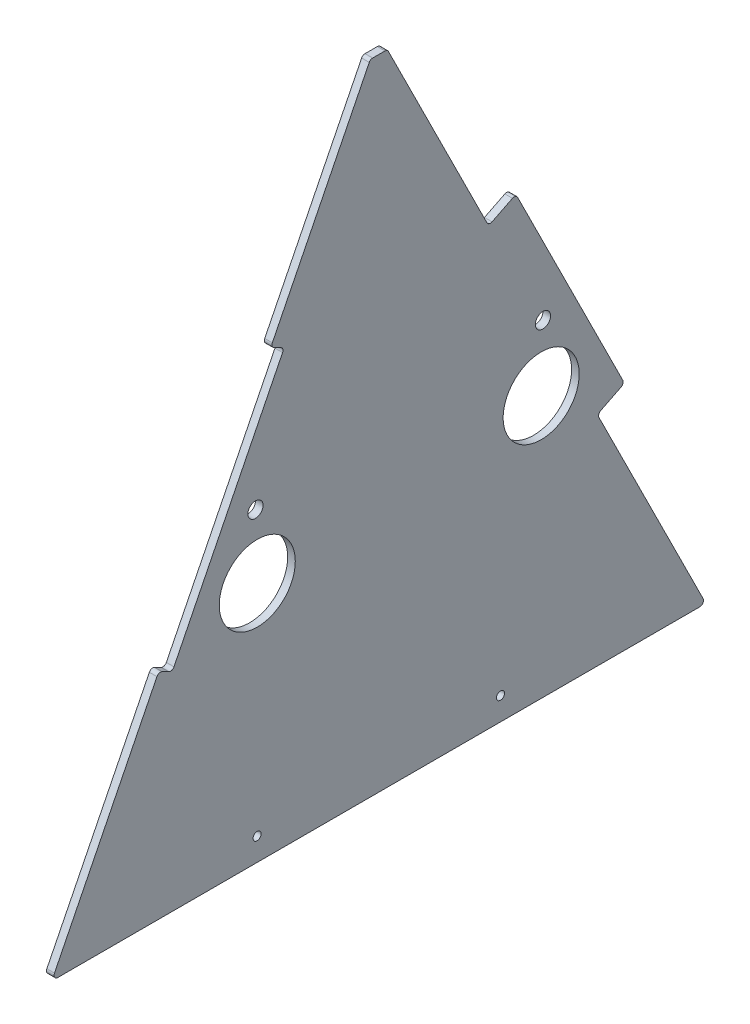
ISO-10303-21;
HEADER;
FILE_DESCRIPTION(('STEP AP214'),'2;1');
FILE_NAME('part.step','',(''),(''),'','','');
FILE_SCHEMA(('AUTOMOTIVE_DESIGN { 1 0 10303 214 1 1 1 1 }'));
ENDSEC;
DATA;
#1=APPLICATION_CONTEXT('core data for automotive mechanical design processes');
#2=APPLICATION_PROTOCOL_DEFINITION('international standard','automotive_design',2000,#1);
#3=PRODUCT_CONTEXT('',#1,'mechanical');
#4=PRODUCT('Part','Part','',(#3));
#5=PRODUCT_RELATED_PRODUCT_CATEGORY('part','',(#4));
#6=PRODUCT_DEFINITION_FORMATION('','',#4);
#7=PRODUCT_DEFINITION_CONTEXT('part definition',#1,'design');
#8=PRODUCT_DEFINITION('design','',#6,#7);
#9=PRODUCT_DEFINITION_SHAPE('','',#8);
#10=(LENGTH_UNIT() NAMED_UNIT(*) SI_UNIT(.MILLI.,.METRE.));
#11=(NAMED_UNIT(*) PLANE_ANGLE_UNIT() SI_UNIT($,.RADIAN.));
#12=(NAMED_UNIT(*) SI_UNIT($,.STERADIAN.) SOLID_ANGLE_UNIT());
#13=UNCERTAINTY_MEASURE_WITH_UNIT(LENGTH_MEASURE(1.E-05),#10,'distance_accuracy_value','');
#14=(GEOMETRIC_REPRESENTATION_CONTEXT(3) GLOBAL_UNCERTAINTY_ASSIGNED_CONTEXT((#13)) GLOBAL_UNIT_ASSIGNED_CONTEXT((#10,
#11,#12)) REPRESENTATION_CONTEXT('',''));
#15=CARTESIAN_POINT('',(0.,0.,0.));
#16=DIRECTION('',(0.,0.,1.));
#17=DIRECTION('',(1.,0.,0.));
#18=AXIS2_PLACEMENT_3D('',#15,#16,#17);
#19=CARTESIAN_POINT('',(6.35,0.,0.));
#20=DIRECTION('',(1.,0.,0.));
#21=DIRECTION('',(0.,0.,-1.));
#22=AXIS2_PLACEMENT_3D('',#19,#20,#21);
#23=PLANE('',#22);
#24=CARTESIAN_POINT('',(6.35,201.821183312528,-171.579254548243));
#25=DIRECTION('',(1.,0.,0.));
#26=DIRECTION('',(0.,0.,-1.));
#27=AXIS2_PLACEMENT_3D('',#24,#25,#26);
#28=CIRCLE('',#27,31.75);
#29=CARTESIAN_POINT('',(6.35,201.821183312528,-203.329254548243));
#30=VERTEX_POINT('',#29);
#31=EDGE_CURVE('E589',#30,#30,#28,.T.);
#32=ORIENTED_EDGE('',*,*,#31,.F.);
#33=EDGE_LOOP('',(#32));
#34=FACE_BOUND('',#33,.T.);
#35=CARTESIAN_POINT('',(6.35,272.775993416298,-410.098906564131));
#36=DIRECTION('',(1.,0.,0.));
#37=DIRECTION('',(0.,0.,-1.));
#38=AXIS2_PLACEMENT_3D('',#35,#36,#37);
#39=CIRCLE('',#38,6.34999999999973);
#40=CARTESIAN_POINT('',(6.35,272.775993416298,-416.448906564131));
#41=VERTEX_POINT('',#40);
#42=EDGE_CURVE('E577',#41,#41,#39,.T.);
#43=ORIENTED_EDGE('',*,*,#42,.F.);
#44=EDGE_LOOP('',(#43));
#45=FACE_BOUND('',#44,.T.);
#46=CARTESIAN_POINT('',(6.35,19.05,-171.45));
#47=DIRECTION('',(1.,0.,0.));
#48=DIRECTION('',(0.,0.,-1.));
#49=AXIS2_PLACEMENT_3D('',#46,#47,#48);
#50=CIRCLE('',#49,3.3734375);
#51=CARTESIAN_POINT('',(6.35,19.05,-174.8234375));
#52=VERTEX_POINT('',#51);
#53=EDGE_CURVE('E224',#52,#52,#50,.T.);
#54=ORIENTED_EDGE('',*,*,#53,.F.);
#55=EDGE_LOOP('',(#54));
#56=FACE_BOUND('',#55,.T.);
#57=DIRECTION('',(0.,0.446197813109807,0.894934361602026));
#58=VECTOR('',#57,1.);
#59=CARTESIAN_POINT('',(6.35,173.342533452951,-100.616383959635));
#60=LINE('',#59,#58);
#61=CARTESIAN_POINT('',(6.35,174.759211509574,-97.7749673615484));
#62=VERTEX_POINT('',#61);
#63=CARTESIAN_POINT('',(6.35,177.592567622822,-92.0921341653755));
#64=VERTEX_POINT('',#63);
#65=EDGE_CURVE('E233',#62,#64,#60,.T.);
#66=ORIENTED_EDGE('',*,*,#65,.T.);
#67=CARTESIAN_POINT('',(6.35,174.751151024735,-90.6754561087519));
#68=DIRECTION('',(1.,0.,0.));
#69=DIRECTION('',(0.,0.,-1.));
#70=AXIS2_PLACEMENT_3D('',#67,#68,#69);
#71=CIRCLE('',#70,3.175);
#72=CARTESIAN_POINT('',(6.35,176.167829081359,-87.8340395106655));
#73=VERTEX_POINT('',#72);
#74=EDGE_CURVE('E293',#64,#73,#71,.T.);
#75=ORIENTED_EDGE('',*,*,#74,.T.);
#76=DIRECTION('',(0.,-0.894934361602026,0.446197813109807));
#77=VECTOR('',#76,1.);
#78=CARTESIAN_POINT('',(6.35,0.,0.));
#79=LINE('',#78,#77);
#80=CARTESIAN_POINT('',(6.35,4.59167805662364,-2.28932622913505));
#81=VERTEX_POINT('',#80);
#82=EDGE_CURVE('E216',#73,#81,#79,.T.);
#83=ORIENTED_EDGE('',*,*,#82,.T.);
#84=CARTESIAN_POINT('',(6.35,3.175,-5.13074282722149));
#85=DIRECTION('',(1.,0.,0.));
#86=DIRECTION('',(0.,0.,-1.));
#87=AXIS2_PLACEMENT_3D('',#84,#85,#86);
#88=CIRCLE('',#87,3.175);
#89=CARTESIAN_POINT('',(6.35,0.,-5.13074282722149));
#90=VERTEX_POINT('',#89);
#91=EDGE_CURVE('E279',#81,#90,#88,.T.);
#92=ORIENTED_EDGE('',*,*,#91,.T.);
#93=DIRECTION('',(0.,0.,-1.));
#94=VECTOR('',#93,1.);
#95=CARTESIAN_POINT('',(6.35,0.,0.));
#96=LINE('',#95,#94);
#97=CARTESIAN_POINT('',(6.35,0.,-540.969257172778));
#98=VERTEX_POINT('',#97);
#99=EDGE_CURVE('E381',#90,#98,#96,.T.);
#100=ORIENTED_EDGE('',*,*,#99,.T.);
#101=CARTESIAN_POINT('',(6.35,3.17500000000001,-540.969257172778));
#102=DIRECTION('',(1.,0.,0.));
#103=DIRECTION('',(0.,0.,-1.));
#104=AXIS2_PLACEMENT_3D('',#101,#102,#103);
#105=CIRCLE('',#104,3.175);
#106=CARTESIAN_POINT('',(6.35,4.59167805662361,-543.810673770865));
#107=VERTEX_POINT('',#106);
#108=EDGE_CURVE('E281',#98,#107,#105,.T.);
#109=ORIENTED_EDGE('',*,*,#108,.T.);
#110=DIRECTION('',(0.,0.894934361602026,0.446197813109807));
#111=VECTOR('',#110,1.);
#112=CARTESIAN_POINT('',(6.35,181.850662277532,-455.432604376087));
#113=LINE('',#112,#111);
#114=CARTESIAN_POINT('',(6.35,179.009245679445,-456.849282432711));
#115=VERTEX_POINT('',#114);
#116=EDGE_CURVE('E372',#107,#115,#113,.T.);
#117=ORIENTED_EDGE('',*,*,#116,.T.);
#118=CARTESIAN_POINT('',(6.35,180.425923736069,-459.690699030797));
#119=DIRECTION('',(1.,0.,0.));
#120=DIRECTION('',(0.,0.,-1.));
#121=AXIS2_PLACEMENT_3D('',#118,#119,#120);
#122=CIRCLE('',#121,3.175);
#123=CARTESIAN_POINT('',(6.35,183.267340334155,-458.274020974174));
#124=VERTEX_POINT('',#123);
#125=EDGE_CURVE('E11',#115,#124,#122,.F.);
#126=ORIENTED_EDGE('',*,*,#125,.T.);
#127=DIRECTION('',(0.,0.446197813109807,-0.894934361602026));
#128=VECTOR('',#127,1.);
#129=CARTESIAN_POINT('',(6.35,193.184086730521,-478.163937160779));
#130=LINE('',#129,#128);
#131=CARTESIAN_POINT('',(6.35,191.767408673897,-475.322520562692));
#132=VERTEX_POINT('',#131);
#133=EDGE_CURVE('E370',#124,#132,#130,.T.);
#134=ORIENTED_EDGE('',*,*,#133,.T.);
#135=CARTESIAN_POINT('',(6.35,194.608825271984,-473.905842506069));
#136=DIRECTION('',(1.,0.,0.));
#137=DIRECTION('',(0.,0.,-1.));
#138=AXIS2_PLACEMENT_3D('',#135,#136,#137);
#139=CIRCLE('',#138,3.175);
#140=CARTESIAN_POINT('',(6.35,196.025503328607,-476.747259104155));
#141=VERTEX_POINT('',#140);
#142=EDGE_CURVE('E283',#132,#141,#139,.T.);
#143=ORIENTED_EDGE('',*,*,#142,.T.);
#144=DIRECTION('',(0.,0.894934361602027,0.446197813109806));
#145=VECTOR('',#144,1.);
#146=CARTESIAN_POINT('',(6.35,375.034749008053,-387.496541536866));
#147=LINE('',#146,#145);
#148=CARTESIAN_POINT('',(6.35,372.193332409966,-388.91321959349));
#149=VERTEX_POINT('',#148);
#150=EDGE_CURVE('E376',#141,#149,#147,.T.);
#151=ORIENTED_EDGE('',*,*,#150,.T.);
#152=CARTESIAN_POINT('',(6.35,370.776654353343,-386.071802995404));
#153=DIRECTION('',(1.,0.,0.));
#154=DIRECTION('',(0.,0.,-1.));
#155=AXIS2_PLACEMENT_3D('',#152,#153,#154);
#156=CIRCLE('',#155,3.175);
#157=CARTESIAN_POINT('',(6.35,373.618070951429,-384.65512493878));
#158=VERTEX_POINT('',#157);
#159=EDGE_CURVE('E285',#149,#158,#156,.T.);
#160=ORIENTED_EDGE('',*,*,#159,.T.);
#161=DIRECTION('',(0.,-0.446197813109806,0.894934361602026));
#162=VECTOR('',#161,1.);
#163=CARTESIAN_POINT('',(6.35,363.701324555063,-364.765208752175));
#164=LINE('',#163,#162);
#165=CARTESIAN_POINT('',(6.35,365.118002611687,-367.606625350261));
#166=VERTEX_POINT('',#165);
#167=EDGE_CURVE('E379',#158,#166,#164,.T.);
#168=ORIENTED_EDGE('',*,*,#167,.T.);
#169=CARTESIAN_POINT('',(6.35,367.959419209774,-366.189947293637));
#170=DIRECTION('',(1.,0.,0.));
#171=DIRECTION('',(0.,0.,-1.));
#172=AXIS2_PLACEMENT_3D('',#169,#170,#171);
#173=CIRCLE('',#172,3.175);
#174=CARTESIAN_POINT('',(6.35,366.54274115315,-363.348530695551));
#175=VERTEX_POINT('',#174);
#176=EDGE_CURVE('E353',#166,#175,#173,.F.);
#177=ORIENTED_EDGE('',*,*,#176,.T.);
#178=DIRECTION('',(0.,0.894934361602026,0.446197813109807));
#179=VECTOR('',#178,1.);
#180=CARTESIAN_POINT('',(6.35,533.4,-280.156570264301));
#181=LINE('',#180,#179);
#182=CARTESIAN_POINT('',(6.35,531.641678056624,-281.033237246305));
#183=VERTEX_POINT('',#182);
#184=EDGE_CURVE('E387',#175,#183,#181,.T.);
#185=ORIENTED_EDGE('',*,*,#184,.T.);
#186=CARTESIAN_POINT('',(6.35,530.225,-278.191820648219));
#187=DIRECTION('',(1.,0.,0.));
#188=DIRECTION('',(0.,0.,-1.));
#189=AXIS2_PLACEMENT_3D('',#186,#187,#188);
#190=CIRCLE('',#189,3.175);
#191=CARTESIAN_POINT('',(6.35,533.4,-278.191820648219));
#192=VERTEX_POINT('',#191);
#193=EDGE_CURVE('E287',#183,#192,#190,.T.);
#194=ORIENTED_EDGE('',*,*,#193,.T.);
#195=DIRECTION('',(0.,0.,1.));
#196=VECTOR('',#195,1.);
#197=CARTESIAN_POINT('',(6.35,533.4,-265.943429735699));
#198=LINE('',#197,#196);
#199=CARTESIAN_POINT('',(6.35,533.4,-267.908179351781));
#200=VERTEX_POINT('',#199);
#201=EDGE_CURVE('E390',#192,#200,#198,.T.);
#202=ORIENTED_EDGE('',*,*,#201,.T.);
#203=CARTESIAN_POINT('',(6.35,530.225,-267.908179351781));
#204=DIRECTION('',(1.,0.,0.));
#205=DIRECTION('',(0.,0.,-1.));
#206=AXIS2_PLACEMENT_3D('',#203,#204,#205);
#207=CIRCLE('',#206,3.175);
#208=CARTESIAN_POINT('',(6.35,531.641678056624,-265.066762753695));
#209=VERTEX_POINT('',#208);
#210=EDGE_CURVE('E289',#200,#209,#207,.T.);
#211=ORIENTED_EDGE('',*,*,#210,.T.);
#212=DIRECTION('',(0.,-0.894934361602026,0.446197813109807));
#213=VECTOR('',#212,1.);
#214=CARTESIAN_POINT('',(6.35,366.54274115315,-182.751469304449));
#215=LINE('',#214,#213);
#216=CARTESIAN_POINT('',(6.35,369.384157751236,-184.168147361073));
#217=VERTEX_POINT('',#216);
#218=EDGE_CURVE('E393',#209,#217,#215,.T.);
#219=ORIENTED_EDGE('',*,*,#218,.T.);
#220=CARTESIAN_POINT('',(6.35,367.967479694613,-187.009563959159));
#221=DIRECTION('',(1.,0.,0.));
#222=DIRECTION('',(0.,0.,-1.));
#223=AXIS2_PLACEMENT_3D('',#220,#221,#222);
#224=CIRCLE('',#223,3.175);
#225=CARTESIAN_POINT('',(6.35,365.126063096526,-185.592885902535));
#226=VERTEX_POINT('',#225);
#227=EDGE_CURVE('E291',#217,#226,#224,.T.);
#228=ORIENTED_EDGE('',*,*,#227,.T.);
#229=DIRECTION('',(0.,-0.446197813109804,-0.894934361602027));
#230=VECTOR('',#229,1.);
#231=CARTESIAN_POINT('',(6.35,366.54274115315,-182.751469304449));
#232=LINE('',#231,#230);
#233=CARTESIAN_POINT('',(6.35,362.292706983279,-191.275719098708));
#234=VERTEX_POINT('',#233);
#235=EDGE_CURVE('E396',#226,#234,#232,.T.);
#236=ORIENTED_EDGE('',*,*,#235,.T.);
#237=CARTESIAN_POINT('',(6.35,359.451290385192,-189.859041042085));
#238=DIRECTION('',(1.,0.,0.));
#239=DIRECTION('',(0.,0.,-1.));
#240=AXIS2_PLACEMENT_3D('',#237,#238,#239);
#241=CIRCLE('',#240,3.175);
#242=CARTESIAN_POINT('',(6.35,358.034612328569,-192.700457640171));
#243=VERTEX_POINT('',#242);
#244=EDGE_CURVE('E56',#234,#243,#241,.F.);
#245=ORIENTED_EDGE('',*,*,#244,.T.);
#246=DIRECTION('',(0.,-0.894934361602026,0.446197813109806));
#247=VECTOR('',#246,1.);
#248=CARTESIAN_POINT('',(6.35,360.876028926655,-194.117135696795));
#249=LINE('',#248,#247);
#250=CARTESIAN_POINT('',(6.35,176.183950051037,-102.033062016258));
#251=VERTEX_POINT('',#250);
#252=EDGE_CURVE('E397',#243,#251,#249,.T.);
#253=ORIENTED_EDGE('',*,*,#252,.T.);
#254=CARTESIAN_POINT('',(6.35,177.600628107661,-99.191645418172));
#255=DIRECTION('',(1.,0.,0.));
#256=DIRECTION('',(0.,0.,-1.));
#257=AXIS2_PLACEMENT_3D('',#254,#255,#256);
#258=CIRCLE('',#257,3.175);
#259=EDGE_CURVE('E346',#251,#62,#258,.F.);
#260=ORIENTED_EDGE('',*,*,#259,.T.);
#261=EDGE_LOOP('',(#66,#75,#83,#92,#100,#109,#117,#126,#134,#143,#151,#160,#168,#177,#185,#194,
#202,#211,#219,#228,#236,#245,#253,#260));
#262=FACE_BOUND('',#261,.T.);
#263=CARTESIAN_POINT('',(6.35,19.05,-374.65));
#264=DIRECTION('',(1.,0.,0.));
#265=DIRECTION('',(0.,0.,-1.));
#266=AXIS2_PLACEMENT_3D('',#263,#264,#265);
#267=CIRCLE('',#266,3.37343750000003);
#268=CARTESIAN_POINT('',(6.35,19.05,-378.0234375));
#269=VERTEX_POINT('',#268);
#270=EDGE_CURVE('E572',#269,#269,#267,.T.);
#271=ORIENTED_EDGE('',*,*,#270,.F.);
#272=EDGE_LOOP('',(#271));
#273=FACE_BOUND('',#272,.T.);
#274=CARTESIAN_POINT('',(6.35,255.775856736814,-170.098092612906));
#275=DIRECTION('',(1.,0.,0.));
#276=DIRECTION('',(0.,0.,-1.));
#277=AXIS2_PLACEMENT_3D('',#274,#275,#276);
#278=CIRCLE('',#277,6.34999999999997);
#279=CARTESIAN_POINT('',(6.35,255.775856736814,-176.448092612906));
#280=VERTEX_POINT('',#279);
#281=EDGE_CURVE('E583',#280,#280,#278,.T.);
#282=ORIENTED_EDGE('',*,*,#281,.F.);
#283=EDGE_LOOP('',(#282));
#284=FACE_BOUND('',#283,.T.);
#285=CARTESIAN_POINT('',(6.35,218.821319992012,-408.617744628794));
#286=DIRECTION('',(1.,0.,0.));
#287=DIRECTION('',(0.,0.,-1.));
#288=AXIS2_PLACEMENT_3D('',#285,#286,#287);
#289=CIRCLE('',#288,31.75);
#290=CARTESIAN_POINT('',(6.35,218.821319992012,-440.367744628794));
#291=VERTEX_POINT('',#290);
#292=EDGE_CURVE('E595',#291,#291,#289,.T.);
#293=ORIENTED_EDGE('',*,*,#292,.F.);
#294=EDGE_LOOP('',(#293));
#295=FACE_BOUND('',#294,.T.);
#296=ADVANCED_FACE('F34',(#34,#45,#56,#262,#273,#284,#295),#23,.T.);
#297=CARTESIAN_POINT('',(0.,0.,0.));
#298=DIRECTION('',(1.,0.,0.));
#299=DIRECTION('',(0.,0.,-1.));
#300=AXIS2_PLACEMENT_3D('',#297,#298,#299);
#301=PLANE('',#300);
#302=DIRECTION('',(0.,-0.894934361602026,0.446197813109807));
#303=VECTOR('',#302,1.);
#304=CARTESIAN_POINT('',(0.,0.,0.));
#305=LINE('',#304,#303);
#306=CARTESIAN_POINT('',(0.,176.167829081359,-87.8340395106655));
#307=VERTEX_POINT('',#306);
#308=CARTESIAN_POINT('',(0.,4.59167805662364,-2.28932622913505));
#309=VERTEX_POINT('',#308);
#310=EDGE_CURVE('E213',#307,#309,#305,.T.);
#311=ORIENTED_EDGE('',*,*,#310,.F.);
#312=CARTESIAN_POINT('',(0.,174.751151024735,-90.6754561087519));
#313=DIRECTION('',(1.,0.,0.));
#314=DIRECTION('',(0.,0.,-1.));
#315=AXIS2_PLACEMENT_3D('',#312,#313,#314);
#316=CIRCLE('',#315,3.175);
#317=CARTESIAN_POINT('',(0.,177.592567622822,-92.0921341653755));
#318=VERTEX_POINT('',#317);
#319=EDGE_CURVE('E196',#307,#318,#316,.F.);
#320=ORIENTED_EDGE('',*,*,#319,.T.);
#321=DIRECTION('',(0.,0.446197813109807,0.894934361602026));
#322=VECTOR('',#321,1.);
#323=CARTESIAN_POINT('',(0.,173.342533452951,-100.616383959635));
#324=LINE('',#323,#322);
#325=CARTESIAN_POINT('',(0.,174.759211509574,-97.7749673615484));
#326=VERTEX_POINT('',#325);
#327=EDGE_CURVE('E261',#326,#318,#324,.T.);
#328=ORIENTED_EDGE('',*,*,#327,.F.);
#329=CARTESIAN_POINT('',(0.,177.600628107661,-99.191645418172));
#330=DIRECTION('',(1.,0.,0.));
#331=DIRECTION('',(0.,0.,-1.));
#332=AXIS2_PLACEMENT_3D('',#329,#330,#331);
#333=CIRCLE('',#332,3.175);
#334=CARTESIAN_POINT('',(0.,176.183950051037,-102.033062016258));
#335=VERTEX_POINT('',#334);
#336=EDGE_CURVE('E344',#326,#335,#333,.T.);
#337=ORIENTED_EDGE('',*,*,#336,.T.);
#338=DIRECTION('',(0.,-0.894934361602026,0.446197813109806));
#339=VECTOR('',#338,1.);
#340=CARTESIAN_POINT('',(0.,360.876028926655,-194.117135696795));
#341=LINE('',#340,#339);
#342=CARTESIAN_POINT('',(0.,358.034612328569,-192.700457640171));
#343=VERTEX_POINT('',#342);
#344=EDGE_CURVE('E259',#343,#335,#341,.T.);
#345=ORIENTED_EDGE('',*,*,#344,.F.);
#346=CARTESIAN_POINT('',(0.,359.451290385192,-189.859041042085));
#347=DIRECTION('',(1.,0.,0.));
#348=DIRECTION('',(0.,0.,-1.));
#349=AXIS2_PLACEMENT_3D('',#346,#347,#348);
#350=CIRCLE('',#349,3.175);
#351=CARTESIAN_POINT('',(0.,362.292706983279,-191.275719098708));
#352=VERTEX_POINT('',#351);
#353=EDGE_CURVE('E348',#343,#352,#350,.T.);
#354=ORIENTED_EDGE('',*,*,#353,.T.);
#355=DIRECTION('',(0.,-0.446197813109804,-0.894934361602027));
#356=VECTOR('',#355,1.);
#357=CARTESIAN_POINT('',(0.,366.54274115315,-182.751469304449));
#358=LINE('',#357,#356);
#359=CARTESIAN_POINT('',(0.,365.126063096526,-185.592885902535));
#360=VERTEX_POINT('',#359);
#361=EDGE_CURVE('E256',#360,#352,#358,.T.);
#362=ORIENTED_EDGE('',*,*,#361,.F.);
#363=CARTESIAN_POINT('',(0.,367.967479694613,-187.009563959159));
#364=DIRECTION('',(1.,0.,0.));
#365=DIRECTION('',(0.,0.,-1.));
#366=AXIS2_PLACEMENT_3D('',#363,#364,#365);
#367=CIRCLE('',#366,3.175);
#368=CARTESIAN_POINT('',(0.,369.384157751236,-184.168147361073));
#369=VERTEX_POINT('',#368);
#370=EDGE_CURVE('E207',#360,#369,#367,.F.);
#371=ORIENTED_EDGE('',*,*,#370,.T.);
#372=DIRECTION('',(0.,-0.894934361602026,0.446197813109807));
#373=VECTOR('',#372,1.);
#374=CARTESIAN_POINT('',(0.,366.54274115315,-182.751469304449));
#375=LINE('',#374,#373);
#376=CARTESIAN_POINT('',(0.,531.641678056624,-265.066762753695));
#377=VERTEX_POINT('',#376);
#378=EDGE_CURVE('E253',#377,#369,#375,.T.);
#379=ORIENTED_EDGE('',*,*,#378,.F.);
#380=CARTESIAN_POINT('',(0.,530.225,-267.908179351781));
#381=DIRECTION('',(1.,0.,0.));
#382=DIRECTION('',(0.,0.,-1.));
#383=AXIS2_PLACEMENT_3D('',#380,#381,#382);
#384=CIRCLE('',#383,3.175);
#385=CARTESIAN_POINT('',(0.,533.4,-267.908179351781));
#386=VERTEX_POINT('',#385);
#387=EDGE_CURVE('E273',#377,#386,#384,.F.);
#388=ORIENTED_EDGE('',*,*,#387,.T.);
#389=DIRECTION('',(0.,0.,1.));
#390=VECTOR('',#389,1.);
#391=CARTESIAN_POINT('',(0.,533.4,-265.943429735699));
#392=LINE('',#391,#390);
#393=CARTESIAN_POINT('',(0.,533.4,-278.191820648219));
#394=VERTEX_POINT('',#393);
#395=EDGE_CURVE('E250',#394,#386,#392,.T.);
#396=ORIENTED_EDGE('',*,*,#395,.F.);
#397=CARTESIAN_POINT('',(0.,530.225,-278.191820648219));
#398=DIRECTION('',(1.,0.,0.));
#399=DIRECTION('',(0.,0.,-1.));
#400=AXIS2_PLACEMENT_3D('',#397,#398,#399);
#401=CIRCLE('',#400,3.175);
#402=CARTESIAN_POINT('',(0.,531.641678056624,-281.033237246305));
#403=VERTEX_POINT('',#402);
#404=EDGE_CURVE('E271',#394,#403,#401,.F.);
#405=ORIENTED_EDGE('',*,*,#404,.T.);
#406=DIRECTION('',(0.,0.894934361602026,0.446197813109807));
#407=VECTOR('',#406,1.);
#408=CARTESIAN_POINT('',(0.,533.4,-280.156570264301));
#409=LINE('',#408,#407);
#410=CARTESIAN_POINT('',(0.,366.54274115315,-363.348530695551));
#411=VERTEX_POINT('',#410);
#412=EDGE_CURVE('E247',#411,#403,#409,.T.);
#413=ORIENTED_EDGE('',*,*,#412,.F.);
#414=CARTESIAN_POINT('',(0.,367.959419209774,-366.189947293637));
#415=DIRECTION('',(1.,0.,0.));
#416=DIRECTION('',(0.,0.,-1.));
#417=AXIS2_PLACEMENT_3D('',#414,#415,#416);
#418=CIRCLE('',#417,3.175);
#419=CARTESIAN_POINT('',(0.,365.118002611687,-367.606625350261));
#420=VERTEX_POINT('',#419);
#421=EDGE_CURVE('E351',#411,#420,#418,.T.);
#422=ORIENTED_EDGE('',*,*,#421,.T.);
#423=DIRECTION('',(0.,-0.446197813109806,0.894934361602026));
#424=VECTOR('',#423,1.);
#425=CARTESIAN_POINT('',(0.,363.701324555063,-364.765208752175));
#426=LINE('',#425,#424);
#427=CARTESIAN_POINT('',(0.,373.618070951429,-384.65512493878));
#428=VERTEX_POINT('',#427);
#429=EDGE_CURVE('E244',#428,#420,#426,.T.);
#430=ORIENTED_EDGE('',*,*,#429,.F.);
#431=CARTESIAN_POINT('',(0.,370.776654353343,-386.071802995404));
#432=DIRECTION('',(1.,0.,0.));
#433=DIRECTION('',(0.,0.,-1.));
#434=AXIS2_PLACEMENT_3D('',#431,#432,#433);
#435=CIRCLE('',#434,3.175);
#436=CARTESIAN_POINT('',(0.,372.193332409966,-388.91321959349));
#437=VERTEX_POINT('',#436);
#438=EDGE_CURVE('E269',#428,#437,#435,.F.);
#439=ORIENTED_EDGE('',*,*,#438,.T.);
#440=DIRECTION('',(0.,0.894934361602027,0.446197813109806));
#441=VECTOR('',#440,1.);
#442=CARTESIAN_POINT('',(0.,375.034749008053,-387.496541536866));
#443=LINE('',#442,#441);
#444=CARTESIAN_POINT('',(0.,196.025503328607,-476.747259104155));
#445=VERTEX_POINT('',#444);
#446=EDGE_CURVE('E241',#445,#437,#443,.T.);
#447=ORIENTED_EDGE('',*,*,#446,.F.);
#448=CARTESIAN_POINT('',(0.,194.608825271984,-473.905842506069));
#449=DIRECTION('',(1.,0.,0.));
#450=DIRECTION('',(0.,0.,-1.));
#451=AXIS2_PLACEMENT_3D('',#448,#449,#450);
#452=CIRCLE('',#451,3.175);
#453=CARTESIAN_POINT('',(0.,191.767408673897,-475.322520562692));
#454=VERTEX_POINT('',#453);
#455=EDGE_CURVE('E267',#445,#454,#452,.F.);
#456=ORIENTED_EDGE('',*,*,#455,.T.);
#457=DIRECTION('',(0.,0.446197813109807,-0.894934361602026));
#458=VECTOR('',#457,1.);
#459=CARTESIAN_POINT('',(0.,193.184086730521,-478.163937160779));
#460=LINE('',#459,#458);
#461=CARTESIAN_POINT('',(0.,183.267340334155,-458.274020974174));
#462=VERTEX_POINT('',#461);
#463=EDGE_CURVE('E238',#462,#454,#460,.T.);
#464=ORIENTED_EDGE('',*,*,#463,.F.);
#465=CARTESIAN_POINT('',(0.,180.425923736069,-459.690699030797));
#466=DIRECTION('',(1.,0.,0.));
#467=DIRECTION('',(0.,0.,-1.));
#468=AXIS2_PLACEMENT_3D('',#465,#466,#467);
#469=CIRCLE('',#468,3.175);
#470=CARTESIAN_POINT('',(0.,179.009245679445,-456.849282432711));
#471=VERTEX_POINT('',#470);
#472=EDGE_CURVE('E42',#462,#471,#469,.T.);
#473=ORIENTED_EDGE('',*,*,#472,.T.);
#474=DIRECTION('',(0.,0.894934361602026,0.446197813109807));
#475=VECTOR('',#474,1.);
#476=CARTESIAN_POINT('',(0.,181.850662277532,-455.432604376087));
#477=LINE('',#476,#475);
#478=CARTESIAN_POINT('',(0.,4.59167805662361,-543.810673770865));
#479=VERTEX_POINT('',#478);
#480=EDGE_CURVE('E227',#479,#471,#477,.T.);
#481=ORIENTED_EDGE('',*,*,#480,.F.);
#482=CARTESIAN_POINT('',(0.,3.17500000000001,-540.969257172778));
#483=DIRECTION('',(1.,0.,0.));
#484=DIRECTION('',(0.,0.,-1.));
#485=AXIS2_PLACEMENT_3D('',#482,#483,#484);
#486=CIRCLE('',#485,3.175);
#487=CARTESIAN_POINT('',(0.,0.,-540.969257172778));
#488=VERTEX_POINT('',#487);
#489=EDGE_CURVE('E265',#479,#488,#486,.F.);
#490=ORIENTED_EDGE('',*,*,#489,.T.);
#491=DIRECTION('',(0.,0.,-1.));
#492=VECTOR('',#491,1.);
#493=CARTESIAN_POINT('',(0.,0.,0.));
#494=LINE('',#493,#492);
#495=CARTESIAN_POINT('',(0.,0.,-5.13074282722149));
#496=VERTEX_POINT('',#495);
#497=EDGE_CURVE('E223',#496,#488,#494,.T.);
#498=ORIENTED_EDGE('',*,*,#497,.F.);
#499=CARTESIAN_POINT('',(0.,3.175,-5.13074282722149));
#500=DIRECTION('',(1.,0.,0.));
#501=DIRECTION('',(0.,0.,-1.));
#502=AXIS2_PLACEMENT_3D('',#499,#500,#501);
#503=CIRCLE('',#502,3.175);
#504=EDGE_CURVE('E217',#496,#309,#503,.F.);
#505=ORIENTED_EDGE('',*,*,#504,.T.);
#506=EDGE_LOOP('',(#311,#320,#328,#337,#345,#354,#362,#371,#379,#388,#396,#405,#413,#422,#430,
#439,#447,#456,#464,#473,#481,#490,#498,#505));
#507=FACE_BOUND('',#506,.T.);
#508=CARTESIAN_POINT('',(0.,19.05,-171.45));
#509=DIRECTION('',(1.,0.,0.));
#510=DIRECTION('',(0.,0.,-1.));
#511=AXIS2_PLACEMENT_3D('',#508,#509,#510);
#512=CIRCLE('',#511,3.3734375);
#513=CARTESIAN_POINT('',(0.,19.05,-174.8234375));
#514=VERTEX_POINT('',#513);
#515=EDGE_CURVE('E230',#514,#514,#512,.T.);
#516=ORIENTED_EDGE('',*,*,#515,.T.);
#517=EDGE_LOOP('',(#516));
#518=FACE_BOUND('',#517,.T.);
#519=CARTESIAN_POINT('',(0.,19.05,-374.65));
#520=DIRECTION('',(1.,0.,0.));
#521=DIRECTION('',(0.,0.,-1.));
#522=AXIS2_PLACEMENT_3D('',#519,#520,#521);
#523=CIRCLE('',#522,3.37343750000003);
#524=CARTESIAN_POINT('',(0.,19.05,-378.0234375));
#525=VERTEX_POINT('',#524);
#526=EDGE_CURVE('E574',#525,#525,#523,.T.);
#527=ORIENTED_EDGE('',*,*,#526,.T.);
#528=EDGE_LOOP('',(#527));
#529=FACE_BOUND('',#528,.T.);
#530=CARTESIAN_POINT('',(0.,272.775993416298,-410.098906564131));
#531=DIRECTION('',(1.,0.,0.));
#532=DIRECTION('',(0.,0.,-1.));
#533=AXIS2_PLACEMENT_3D('',#530,#531,#532);
#534=CIRCLE('',#533,6.34999999999973);
#535=CARTESIAN_POINT('',(0.,272.775993416298,-416.448906564131));
#536=VERTEX_POINT('',#535);
#537=EDGE_CURVE('E580',#536,#536,#534,.T.);
#538=ORIENTED_EDGE('',*,*,#537,.T.);
#539=EDGE_LOOP('',(#538));
#540=FACE_BOUND('',#539,.T.);
#541=CARTESIAN_POINT('',(0.,255.775856736814,-170.098092612906));
#542=DIRECTION('',(1.,0.,0.));
#543=DIRECTION('',(0.,0.,-1.));
#544=AXIS2_PLACEMENT_3D('',#541,#542,#543);
#545=CIRCLE('',#544,6.34999999999997);
#546=CARTESIAN_POINT('',(0.,255.775856736814,-176.448092612906));
#547=VERTEX_POINT('',#546);
#548=EDGE_CURVE('E586',#547,#547,#545,.T.);
#549=ORIENTED_EDGE('',*,*,#548,.T.);
#550=EDGE_LOOP('',(#549));
#551=FACE_BOUND('',#550,.T.);
#552=CARTESIAN_POINT('',(0.,201.821183312528,-171.579254548243));
#553=DIRECTION('',(1.,0.,0.));
#554=DIRECTION('',(0.,0.,-1.));
#555=AXIS2_PLACEMENT_3D('',#552,#553,#554);
#556=CIRCLE('',#555,31.75);
#557=CARTESIAN_POINT('',(0.,201.821183312528,-203.329254548243));
#558=VERTEX_POINT('',#557);
#559=EDGE_CURVE('E592',#558,#558,#556,.T.);
#560=ORIENTED_EDGE('',*,*,#559,.T.);
#561=EDGE_LOOP('',(#560));
#562=FACE_BOUND('',#561,.T.);
#563=CARTESIAN_POINT('',(0.,218.821319992012,-408.617744628794));
#564=DIRECTION('',(1.,0.,0.));
#565=DIRECTION('',(0.,0.,-1.));
#566=AXIS2_PLACEMENT_3D('',#563,#564,#565);
#567=CIRCLE('',#566,31.75);
#568=CARTESIAN_POINT('',(0.,218.821319992012,-440.367744628794));
#569=VERTEX_POINT('',#568);
#570=EDGE_CURVE('E598',#569,#569,#567,.T.);
#571=ORIENTED_EDGE('',*,*,#570,.T.);
#572=EDGE_LOOP('',(#571));
#573=FACE_BOUND('',#572,.T.);
#574=ADVANCED_FACE('F220',(#507,#518,#529,#540,#551,#562,#573),#301,.F.);
#575=CARTESIAN_POINT('',(6.35,0.,0.));
#576=DIRECTION('',(0.,-0.446197813109807,-0.894934361602026));
#577=DIRECTION('',(0.,0.894934361602026,-0.446197813109807));
#578=AXIS2_PLACEMENT_3D('',#575,#576,#577);
#579=PLANE('',#578);
#580=ORIENTED_EDGE('',*,*,#82,.F.);
#581=DIRECTION('',(-1.,0.,0.));
#582=VECTOR('',#581,1.);
#583=CARTESIAN_POINT('',(6.35,176.167829081359,-87.8340395106655));
#584=LINE('',#583,#582);
#585=EDGE_CURVE('E200',#73,#307,#584,.T.);
#586=ORIENTED_EDGE('',*,*,#585,.T.);
#587=ORIENTED_EDGE('',*,*,#310,.T.);
#588=DIRECTION('',(-1.,0.,0.));
#589=VECTOR('',#588,1.);
#590=CARTESIAN_POINT('',(6.35,4.59167805662364,-2.28932622913506));
#591=LINE('',#590,#589);
#592=EDGE_CURVE('E218',#309,#81,#591,.F.);
#593=ORIENTED_EDGE('',*,*,#592,.T.);
#594=EDGE_LOOP('',(#580,#586,#587,#593));
#595=FACE_BOUND('',#594,.T.);
#596=ADVANCED_FACE('F212',(#595),#579,.F.);
#597=CARTESIAN_POINT('',(6.35,0.,0.));
#598=DIRECTION('',(0.,1.,0.));
#599=DIRECTION('',(0.,0.,1.));
#600=AXIS2_PLACEMENT_3D('',#597,#598,#599);
#601=PLANE('',#600);
#602=ORIENTED_EDGE('',*,*,#497,.T.);
#603=DIRECTION('',(-1.,0.,0.));
#604=VECTOR('',#603,1.);
#605=CARTESIAN_POINT('',(6.35,0.,-540.969257172778));
#606=LINE('',#605,#604);
#607=EDGE_CURVE('E342',#488,#98,#606,.F.);
#608=ORIENTED_EDGE('',*,*,#607,.T.);
#609=ORIENTED_EDGE('',*,*,#99,.F.);
#610=DIRECTION('',(-1.,0.,0.));
#611=VECTOR('',#610,1.);
#612=CARTESIAN_POINT('',(6.35,0.,-5.13074282722149));
#613=LINE('',#612,#611);
#614=EDGE_CURVE('E339',#90,#496,#613,.T.);
#615=ORIENTED_EDGE('',*,*,#614,.T.);
#616=EDGE_LOOP('',(#602,#608,#609,#615));
#617=FACE_BOUND('',#616,.T.);
#618=ADVANCED_FACE('F505',(#617),#601,.F.);
#619=CARTESIAN_POINT('',(6.35,181.850662277532,-455.432604376087));
#620=DIRECTION('',(0.,-0.446197813109807,0.894934361602026));
#621=DIRECTION('',(0.,-0.894934361602026,-0.446197813109807));
#622=AXIS2_PLACEMENT_3D('',#619,#620,#621);
#623=PLANE('',#622);
#624=ORIENTED_EDGE('',*,*,#480,.T.);
#625=DIRECTION('',(-1.,0.,0.));
#626=VECTOR('',#625,1.);
#627=CARTESIAN_POINT('',(6.35,179.009245679445,-456.849282432711));
#628=LINE('',#627,#626);
#629=EDGE_CURVE('E337',#471,#115,#628,.F.);
#630=ORIENTED_EDGE('',*,*,#629,.T.);
#631=ORIENTED_EDGE('',*,*,#116,.F.);
#632=DIRECTION('',(-1.,0.,0.));
#633=VECTOR('',#632,1.);
#634=CARTESIAN_POINT('',(6.35,4.59167805662367,-543.810673770865));
#635=LINE('',#634,#633);
#636=EDGE_CURVE('E334',#107,#479,#635,.T.);
#637=ORIENTED_EDGE('',*,*,#636,.T.);
#638=EDGE_LOOP('',(#624,#630,#631,#637));
#639=FACE_BOUND('',#638,.T.);
#640=ADVANCED_FACE('F360',(#639),#623,.F.);
#641=CARTESIAN_POINT('',(6.35,193.184086730521,-478.163937160779));
#642=DIRECTION('',(0.,0.894934361602026,0.446197813109807));
#643=DIRECTION('',(0.,-0.446197813109807,0.894934361602026));
#644=AXIS2_PLACEMENT_3D('',#641,#642,#643);
#645=PLANE('',#644);
#646=ORIENTED_EDGE('',*,*,#463,.T.);
#647=DIRECTION('',(-1.,0.,0.));
#648=VECTOR('',#647,1.);
#649=CARTESIAN_POINT('',(6.35,191.767408673897,-475.322520562692));
#650=LINE('',#649,#648);
#651=EDGE_CURVE('E332',#454,#132,#650,.F.);
#652=ORIENTED_EDGE('',*,*,#651,.T.);
#653=ORIENTED_EDGE('',*,*,#133,.F.);
#654=DIRECTION('',(-1.,0.,0.));
#655=VECTOR('',#654,1.);
#656=CARTESIAN_POINT('',(0.,183.267340334155,-458.274020974174));
#657=LINE('',#656,#655);
#658=EDGE_CURVE('E329',#124,#462,#657,.T.);
#659=ORIENTED_EDGE('',*,*,#658,.T.);
#660=EDGE_LOOP('',(#646,#652,#653,#659));
#661=FACE_BOUND('',#660,.T.);
#662=ADVANCED_FACE('F374',(#661),#645,.F.);
#663=CARTESIAN_POINT('',(6.35,375.034749008053,-387.496541536866));
#664=DIRECTION('',(0.,-0.446197813109806,0.894934361602027));
#665=DIRECTION('',(0.,-0.894934361602027,-0.446197813109806));
#666=AXIS2_PLACEMENT_3D('',#663,#664,#665);
#667=PLANE('',#666);
#668=ORIENTED_EDGE('',*,*,#446,.T.);
#669=DIRECTION('',(-1.,0.,0.));
#670=VECTOR('',#669,1.);
#671=CARTESIAN_POINT('',(6.35,372.193332409966,-388.91321959349));
#672=LINE('',#671,#670);
#673=EDGE_CURVE('E327',#437,#149,#672,.F.);
#674=ORIENTED_EDGE('',*,*,#673,.T.);
#675=ORIENTED_EDGE('',*,*,#150,.F.);
#676=DIRECTION('',(-1.,0.,0.));
#677=VECTOR('',#676,1.);
#678=CARTESIAN_POINT('',(6.35,196.025503328607,-476.747259104155));
#679=LINE('',#678,#677);
#680=EDGE_CURVE('E324',#141,#445,#679,.T.);
#681=ORIENTED_EDGE('',*,*,#680,.T.);
#682=EDGE_LOOP('',(#668,#674,#675,#681));
#683=FACE_BOUND('',#682,.T.);
#684=ADVANCED_FACE('F458',(#683),#667,.F.);
#685=CARTESIAN_POINT('',(6.35,363.701324555063,-364.765208752175));
#686=DIRECTION('',(0.,-0.894934361602026,-0.446197813109806));
#687=DIRECTION('',(0.,0.446197813109806,-0.894934361602026));
#688=AXIS2_PLACEMENT_3D('',#685,#686,#687);
#689=PLANE('',#688);
#690=ORIENTED_EDGE('',*,*,#429,.T.);
#691=DIRECTION('',(-1.,0.,0.));
#692=VECTOR('',#691,1.);
#693=CARTESIAN_POINT('',(6.35,365.118002611687,-367.606625350261));
#694=LINE('',#693,#692);
#695=EDGE_CURVE('E322',#420,#166,#694,.F.);
#696=ORIENTED_EDGE('',*,*,#695,.T.);
#697=ORIENTED_EDGE('',*,*,#167,.F.);
#698=DIRECTION('',(-1.,0.,0.));
#699=VECTOR('',#698,1.);
#700=CARTESIAN_POINT('',(6.35,373.618070951429,-384.65512493878));
#701=LINE('',#700,#699);
#702=EDGE_CURVE('E319',#158,#428,#701,.T.);
#703=ORIENTED_EDGE('',*,*,#702,.T.);
#704=EDGE_LOOP('',(#690,#696,#697,#703));
#705=FACE_BOUND('',#704,.T.);
#706=ADVANCED_FACE('F449',(#705),#689,.F.);
#707=CARTESIAN_POINT('',(6.35,533.4,-280.156570264301));
#708=DIRECTION('',(0.,-0.446197813109807,0.894934361602026));
#709=DIRECTION('',(0.,-0.894934361602026,-0.446197813109807));
#710=AXIS2_PLACEMENT_3D('',#707,#708,#709);
#711=PLANE('',#710);
#712=ORIENTED_EDGE('',*,*,#412,.T.);
#713=DIRECTION('',(-1.,0.,0.));
#714=VECTOR('',#713,1.);
#715=CARTESIAN_POINT('',(6.35,531.641678056624,-281.033237246305));
#716=LINE('',#715,#714);
#717=EDGE_CURVE('E317',#403,#183,#716,.F.);
#718=ORIENTED_EDGE('',*,*,#717,.T.);
#719=ORIENTED_EDGE('',*,*,#184,.F.);
#720=DIRECTION('',(-1.,0.,0.));
#721=VECTOR('',#720,1.);
#722=CARTESIAN_POINT('',(0.,366.54274115315,-363.348530695551));
#723=LINE('',#722,#721);
#724=EDGE_CURVE('E314',#175,#411,#723,.T.);
#725=ORIENTED_EDGE('',*,*,#724,.T.);
#726=EDGE_LOOP('',(#712,#718,#719,#725));
#727=FACE_BOUND('',#726,.T.);
#728=ADVANCED_FACE('F440',(#727),#711,.F.);
#729=CARTESIAN_POINT('',(6.35,533.4,-265.943429735699));
#730=DIRECTION('',(0.,-1.,0.));
#731=DIRECTION('',(0.,0.,-1.));
#732=AXIS2_PLACEMENT_3D('',#729,#730,#731);
#733=PLANE('',#732);
#734=ORIENTED_EDGE('',*,*,#395,.T.);
#735=DIRECTION('',(-1.,0.,0.));
#736=VECTOR('',#735,1.);
#737=CARTESIAN_POINT('',(6.35,533.4,-267.908179351781));
#738=LINE('',#737,#736);
#739=EDGE_CURVE('E312',#386,#200,#738,.F.);
#740=ORIENTED_EDGE('',*,*,#739,.T.);
#741=ORIENTED_EDGE('',*,*,#201,.F.);
#742=DIRECTION('',(-1.,0.,0.));
#743=VECTOR('',#742,1.);
#744=CARTESIAN_POINT('',(6.35,533.4,-278.191820648219));
#745=LINE('',#744,#743);
#746=EDGE_CURVE('E309',#192,#394,#745,.T.);
#747=ORIENTED_EDGE('',*,*,#746,.T.);
#748=EDGE_LOOP('',(#734,#740,#741,#747));
#749=FACE_BOUND('',#748,.T.);
#750=ADVANCED_FACE('F431',(#749),#733,.F.);
#751=CARTESIAN_POINT('',(6.35,366.54274115315,-182.751469304449));
#752=DIRECTION('',(0.,-0.446197813109807,-0.894934361602026));
#753=DIRECTION('',(0.,0.894934361602026,-0.446197813109807));
#754=AXIS2_PLACEMENT_3D('',#751,#752,#753);
#755=PLANE('',#754);
#756=ORIENTED_EDGE('',*,*,#378,.T.);
#757=DIRECTION('',(-1.,0.,0.));
#758=VECTOR('',#757,1.);
#759=CARTESIAN_POINT('',(6.35,369.384157751236,-184.168147361073));
#760=LINE('',#759,#758);
#761=EDGE_CURVE('E307',#369,#217,#760,.F.);
#762=ORIENTED_EDGE('',*,*,#761,.T.);
#763=ORIENTED_EDGE('',*,*,#218,.F.);
#764=DIRECTION('',(-1.,0.,0.));
#765=VECTOR('',#764,1.);
#766=CARTESIAN_POINT('',(6.35,531.641678056624,-265.066762753695));
#767=LINE('',#766,#765);
#768=EDGE_CURVE('E304',#209,#377,#767,.T.);
#769=ORIENTED_EDGE('',*,*,#768,.T.);
#770=EDGE_LOOP('',(#756,#762,#763,#769));
#771=FACE_BOUND('',#770,.T.);
#772=ADVANCED_FACE('F422',(#771),#755,.F.);
#773=CARTESIAN_POINT('',(6.35,366.54274115315,-182.751469304449));
#774=DIRECTION('',(0.,0.894934361602027,-0.446197813109804));
#775=DIRECTION('',(0.,0.446197813109804,0.894934361602027));
#776=AXIS2_PLACEMENT_3D('',#773,#774,#775);
#777=PLANE('',#776);
#778=ORIENTED_EDGE('',*,*,#361,.T.);
#779=DIRECTION('',(-1.,0.,0.));
#780=VECTOR('',#779,1.);
#781=CARTESIAN_POINT('',(6.35,362.292706983279,-191.275719098708));
#782=LINE('',#781,#780);
#783=EDGE_CURVE('E302',#352,#234,#782,.F.);
#784=ORIENTED_EDGE('',*,*,#783,.T.);
#785=ORIENTED_EDGE('',*,*,#235,.F.);
#786=DIRECTION('',(-1.,0.,0.));
#787=VECTOR('',#786,1.);
#788=CARTESIAN_POINT('',(6.35,365.126063096526,-185.592885902535));
#789=LINE('',#788,#787);
#790=EDGE_CURVE('E299',#226,#360,#789,.T.);
#791=ORIENTED_EDGE('',*,*,#790,.T.);
#792=EDGE_LOOP('',(#778,#784,#785,#791));
#793=FACE_BOUND('',#792,.T.);
#794=ADVANCED_FACE('F413',(#793),#777,.F.);
#795=CARTESIAN_POINT('',(6.35,360.876028926655,-194.117135696795));
#796=DIRECTION('',(0.,-0.446197813109807,-0.894934361602026));
#797=DIRECTION('',(0.,0.894934361602026,-0.446197813109807));
#798=AXIS2_PLACEMENT_3D('',#795,#796,#797);
#799=PLANE('',#798);
#800=ORIENTED_EDGE('',*,*,#344,.T.);
#801=DIRECTION('',(-1.,0.,0.));
#802=VECTOR('',#801,1.);
#803=CARTESIAN_POINT('',(6.35,176.183950051037,-102.033062016258));
#804=LINE('',#803,#802);
#805=EDGE_CURVE('E49',#335,#251,#804,.F.);
#806=ORIENTED_EDGE('',*,*,#805,.T.);
#807=ORIENTED_EDGE('',*,*,#252,.F.);
#808=DIRECTION('',(-1.,0.,0.));
#809=VECTOR('',#808,1.);
#810=CARTESIAN_POINT('',(0.,358.034612328569,-192.700457640171));
#811=LINE('',#810,#809);
#812=EDGE_CURVE('E295',#243,#343,#811,.T.);
#813=ORIENTED_EDGE('',*,*,#812,.T.);
#814=EDGE_LOOP('',(#800,#806,#807,#813));
#815=FACE_BOUND('',#814,.T.);
#816=ADVANCED_FACE('F406',(#815),#799,.F.);
#817=CARTESIAN_POINT('',(6.35,173.342533452951,-100.616383959635));
#818=DIRECTION('',(0.,-0.894934361602026,0.446197813109807));
#819=DIRECTION('',(0.,-0.446197813109807,-0.894934361602026));
#820=AXIS2_PLACEMENT_3D('',#817,#818,#819);
#821=PLANE('',#820);
#822=ORIENTED_EDGE('',*,*,#327,.T.);
#823=DIRECTION('',(-1.,0.,0.));
#824=VECTOR('',#823,1.);
#825=CARTESIAN_POINT('',(6.35,177.592567622822,-92.0921341653755));
#826=LINE('',#825,#824);
#827=EDGE_CURVE('E201',#318,#64,#826,.F.);
#828=ORIENTED_EDGE('',*,*,#827,.T.);
#829=ORIENTED_EDGE('',*,*,#65,.F.);
#830=DIRECTION('',(-1.,0.,0.));
#831=VECTOR('',#830,1.);
#832=CARTESIAN_POINT('',(0.,174.759211509574,-97.7749673615484));
#833=LINE('',#832,#831);
#834=EDGE_CURVE('E206',#62,#326,#833,.T.);
#835=ORIENTED_EDGE('',*,*,#834,.T.);
#836=EDGE_LOOP('',(#822,#828,#829,#835));
#837=FACE_BOUND('',#836,.T.);
#838=ADVANCED_FACE('F402',(#837),#821,.F.);
#839=CARTESIAN_POINT('',(6.35,19.05,-171.45));
#840=DIRECTION('',(-1.,0.,0.));
#841=DIRECTION('',(0.,0.,1.));
#842=AXIS2_PLACEMENT_3D('',#839,#840,#841);
#843=CYLINDRICAL_SURFACE('',#842,3.3734375);
#844=ORIENTED_EDGE('',*,*,#53,.T.);
#845=EDGE_LOOP('',(#844));
#846=FACE_BOUND('',#845,.T.);
#847=ORIENTED_EDGE('',*,*,#515,.F.);
#848=EDGE_LOOP('',(#847));
#849=FACE_BOUND('',#848,.T.);
#850=ADVANCED_FACE('F482',(#846,#849),#843,.F.);
#851=CARTESIAN_POINT('',(6.35,19.05,-374.65));
#852=DIRECTION('',(-1.,0.,0.));
#853=DIRECTION('',(0.,0.,1.));
#854=AXIS2_PLACEMENT_3D('',#851,#852,#853);
#855=CYLINDRICAL_SURFACE('',#854,3.37343750000003);
#856=ORIENTED_EDGE('',*,*,#270,.T.);
#857=EDGE_LOOP('',(#856));
#858=FACE_BOUND('',#857,.T.);
#859=ORIENTED_EDGE('',*,*,#526,.F.);
#860=EDGE_LOOP('',(#859));
#861=FACE_BOUND('',#860,.T.);
#862=ADVANCED_FACE('F623',(#858,#861),#855,.F.);
#863=CARTESIAN_POINT('',(6.35,272.775993416298,-410.098906564131));
#864=DIRECTION('',(-1.,0.,0.));
#865=DIRECTION('',(0.,0.,1.));
#866=AXIS2_PLACEMENT_3D('',#863,#864,#865);
#867=CYLINDRICAL_SURFACE('',#866,6.34999999999973);
#868=ORIENTED_EDGE('',*,*,#42,.T.);
#869=EDGE_LOOP('',(#868));
#870=FACE_BOUND('',#869,.T.);
#871=ORIENTED_EDGE('',*,*,#537,.F.);
#872=EDGE_LOOP('',(#871));
#873=FACE_BOUND('',#872,.T.);
#874=ADVANCED_FACE('F620',(#870,#873),#867,.F.);
#875=CARTESIAN_POINT('',(6.35,255.775856736814,-170.098092612906));
#876=DIRECTION('',(-1.,0.,0.));
#877=DIRECTION('',(0.,0.,1.));
#878=AXIS2_PLACEMENT_3D('',#875,#876,#877);
#879=CYLINDRICAL_SURFACE('',#878,6.34999999999997);
#880=ORIENTED_EDGE('',*,*,#281,.T.);
#881=EDGE_LOOP('',(#880));
#882=FACE_BOUND('',#881,.T.);
#883=ORIENTED_EDGE('',*,*,#548,.F.);
#884=EDGE_LOOP('',(#883));
#885=FACE_BOUND('',#884,.T.);
#886=ADVANCED_FACE('F614',(#882,#885),#879,.F.);
#887=CARTESIAN_POINT('',(6.35,201.821183312528,-171.579254548243));
#888=DIRECTION('',(-1.,0.,0.));
#889=DIRECTION('',(0.,0.,1.));
#890=AXIS2_PLACEMENT_3D('',#887,#888,#889);
#891=CYLINDRICAL_SURFACE('',#890,31.75);
#892=ORIENTED_EDGE('',*,*,#31,.T.);
#893=EDGE_LOOP('',(#892));
#894=FACE_BOUND('',#893,.T.);
#895=ORIENTED_EDGE('',*,*,#559,.F.);
#896=EDGE_LOOP('',(#895));
#897=FACE_BOUND('',#896,.T.);
#898=ADVANCED_FACE('F607',(#894,#897),#891,.F.);
#899=CARTESIAN_POINT('',(6.35,218.821319992012,-408.617744628794));
#900=DIRECTION('',(-1.,0.,0.));
#901=DIRECTION('',(0.,0.,1.));
#902=AXIS2_PLACEMENT_3D('',#899,#900,#901);
#903=CYLINDRICAL_SURFACE('',#902,31.75);
#904=ORIENTED_EDGE('',*,*,#292,.T.);
#905=EDGE_LOOP('',(#904));
#906=FACE_BOUND('',#905,.T.);
#907=ORIENTED_EDGE('',*,*,#570,.F.);
#908=EDGE_LOOP('',(#907));
#909=FACE_BOUND('',#908,.T.);
#910=ADVANCED_FACE('F513',(#906,#909),#903,.F.);
#911=CARTESIAN_POINT('',(6.35,174.751151024735,-90.6754561087519));
#912=DIRECTION('',(-1.,0.,0.));
#913=DIRECTION('',(0.,0.,1.));
#914=AXIS2_PLACEMENT_3D('',#911,#912,#913);
#915=CYLINDRICAL_SURFACE('',#914,3.175);
#916=ORIENTED_EDGE('',*,*,#74,.F.);
#917=ORIENTED_EDGE('',*,*,#827,.F.);
#918=ORIENTED_EDGE('',*,*,#319,.F.);
#919=ORIENTED_EDGE('',*,*,#585,.F.);
#920=EDGE_LOOP('',(#916,#917,#918,#919));
#921=FACE_BOUND('',#920,.T.);
#922=ADVANCED_FACE('F199',(#921),#915,.T.);
#923=CARTESIAN_POINT('',(6.35,177.600628107661,-99.191645418172));
#924=DIRECTION('',(1.,0.,0.));
#925=DIRECTION('',(0.,0.,-1.));
#926=AXIS2_PLACEMENT_3D('',#923,#924,#925);
#927=CYLINDRICAL_SURFACE('',#926,3.175);
#928=ORIENTED_EDGE('',*,*,#259,.F.);
#929=ORIENTED_EDGE('',*,*,#805,.F.);
#930=ORIENTED_EDGE('',*,*,#336,.F.);
#931=ORIENTED_EDGE('',*,*,#834,.F.);
#932=EDGE_LOOP('',(#928,#929,#930,#931));
#933=FACE_BOUND('',#932,.T.);
#934=ADVANCED_FACE('F404',(#933),#927,.F.);
#935=CARTESIAN_POINT('',(6.35,359.451290385192,-189.859041042085));
#936=DIRECTION('',(1.,0.,0.));
#937=DIRECTION('',(0.,0.,-1.));
#938=AXIS2_PLACEMENT_3D('',#935,#936,#937);
#939=CYLINDRICAL_SURFACE('',#938,3.175);
#940=ORIENTED_EDGE('',*,*,#244,.F.);
#941=ORIENTED_EDGE('',*,*,#783,.F.);
#942=ORIENTED_EDGE('',*,*,#353,.F.);
#943=ORIENTED_EDGE('',*,*,#812,.F.);
#944=EDGE_LOOP('',(#940,#941,#942,#943));
#945=FACE_BOUND('',#944,.T.);
#946=ADVANCED_FACE('F409',(#945),#939,.F.);
#947=CARTESIAN_POINT('',(6.35,367.967479694613,-187.009563959159));
#948=DIRECTION('',(-1.,0.,0.));
#949=DIRECTION('',(0.,0.,1.));
#950=AXIS2_PLACEMENT_3D('',#947,#948,#949);
#951=CYLINDRICAL_SURFACE('',#950,3.175);
#952=ORIENTED_EDGE('',*,*,#227,.F.);
#953=ORIENTED_EDGE('',*,*,#761,.F.);
#954=ORIENTED_EDGE('',*,*,#370,.F.);
#955=ORIENTED_EDGE('',*,*,#790,.F.);
#956=EDGE_LOOP('',(#952,#953,#954,#955));
#957=FACE_BOUND('',#956,.T.);
#958=ADVANCED_FACE('F418',(#957),#951,.T.);
#959=CARTESIAN_POINT('',(6.35,530.225,-267.908179351781));
#960=DIRECTION('',(-1.,0.,0.));
#961=DIRECTION('',(0.,0.,1.));
#962=AXIS2_PLACEMENT_3D('',#959,#960,#961);
#963=CYLINDRICAL_SURFACE('',#962,3.175);
#964=ORIENTED_EDGE('',*,*,#210,.F.);
#965=ORIENTED_EDGE('',*,*,#739,.F.);
#966=ORIENTED_EDGE('',*,*,#387,.F.);
#967=ORIENTED_EDGE('',*,*,#768,.F.);
#968=EDGE_LOOP('',(#964,#965,#966,#967));
#969=FACE_BOUND('',#968,.T.);
#970=ADVANCED_FACE('F427',(#969),#963,.T.);
#971=CARTESIAN_POINT('',(6.35,530.225,-278.191820648219));
#972=DIRECTION('',(-1.,0.,0.));
#973=DIRECTION('',(0.,0.,1.));
#974=AXIS2_PLACEMENT_3D('',#971,#972,#973);
#975=CYLINDRICAL_SURFACE('',#974,3.175);
#976=ORIENTED_EDGE('',*,*,#193,.F.);
#977=ORIENTED_EDGE('',*,*,#717,.F.);
#978=ORIENTED_EDGE('',*,*,#404,.F.);
#979=ORIENTED_EDGE('',*,*,#746,.F.);
#980=EDGE_LOOP('',(#976,#977,#978,#979));
#981=FACE_BOUND('',#980,.T.);
#982=ADVANCED_FACE('F436',(#981),#975,.T.);
#983=CARTESIAN_POINT('',(6.35,367.959419209774,-366.189947293637));
#984=DIRECTION('',(1.,0.,0.));
#985=DIRECTION('',(0.,0.,-1.));
#986=AXIS2_PLACEMENT_3D('',#983,#984,#985);
#987=CYLINDRICAL_SURFACE('',#986,3.175);
#988=ORIENTED_EDGE('',*,*,#176,.F.);
#989=ORIENTED_EDGE('',*,*,#695,.F.);
#990=ORIENTED_EDGE('',*,*,#421,.F.);
#991=ORIENTED_EDGE('',*,*,#724,.F.);
#992=EDGE_LOOP('',(#988,#989,#990,#991));
#993=FACE_BOUND('',#992,.T.);
#994=ADVANCED_FACE('F445',(#993),#987,.F.);
#995=CARTESIAN_POINT('',(6.35,370.776654353343,-386.071802995404));
#996=DIRECTION('',(-1.,0.,0.));
#997=DIRECTION('',(0.,0.,1.));
#998=AXIS2_PLACEMENT_3D('',#995,#996,#997);
#999=CYLINDRICAL_SURFACE('',#998,3.175);
#1000=ORIENTED_EDGE('',*,*,#159,.F.);
#1001=ORIENTED_EDGE('',*,*,#673,.F.);
#1002=ORIENTED_EDGE('',*,*,#438,.F.);
#1003=ORIENTED_EDGE('',*,*,#702,.F.);
#1004=EDGE_LOOP('',(#1000,#1001,#1002,#1003));
#1005=FACE_BOUND('',#1004,.T.);
#1006=ADVANCED_FACE('F454',(#1005),#999,.T.);
#1007=CARTESIAN_POINT('',(6.35,194.608825271984,-473.905842506069));
#1008=DIRECTION('',(-1.,0.,0.));
#1009=DIRECTION('',(0.,0.,1.));
#1010=AXIS2_PLACEMENT_3D('',#1007,#1008,#1009);
#1011=CYLINDRICAL_SURFACE('',#1010,3.175);
#1012=ORIENTED_EDGE('',*,*,#142,.F.);
#1013=ORIENTED_EDGE('',*,*,#651,.F.);
#1014=ORIENTED_EDGE('',*,*,#455,.F.);
#1015=ORIENTED_EDGE('',*,*,#680,.F.);
#1016=EDGE_LOOP('',(#1012,#1013,#1014,#1015));
#1017=FACE_BOUND('',#1016,.T.);
#1018=ADVANCED_FACE('F462',(#1017),#1011,.T.);
#1019=CARTESIAN_POINT('',(6.35,180.425923736069,-459.690699030797));
#1020=DIRECTION('',(1.,0.,0.));
#1021=DIRECTION('',(0.,0.,-1.));
#1022=AXIS2_PLACEMENT_3D('',#1019,#1020,#1021);
#1023=CYLINDRICAL_SURFACE('',#1022,3.175);
#1024=ORIENTED_EDGE('',*,*,#125,.F.);
#1025=ORIENTED_EDGE('',*,*,#629,.F.);
#1026=ORIENTED_EDGE('',*,*,#472,.F.);
#1027=ORIENTED_EDGE('',*,*,#658,.F.);
#1028=EDGE_LOOP('',(#1024,#1025,#1026,#1027));
#1029=FACE_BOUND('',#1028,.T.);
#1030=ADVANCED_FACE('F365',(#1029),#1023,.F.);
#1031=CARTESIAN_POINT('',(6.35,3.17500000000001,-540.969257172778));
#1032=DIRECTION('',(-1.,0.,0.));
#1033=DIRECTION('',(0.,0.,1.));
#1034=AXIS2_PLACEMENT_3D('',#1031,#1032,#1033);
#1035=CYLINDRICAL_SURFACE('',#1034,3.175);
#1036=ORIENTED_EDGE('',*,*,#108,.F.);
#1037=ORIENTED_EDGE('',*,*,#607,.F.);
#1038=ORIENTED_EDGE('',*,*,#489,.F.);
#1039=ORIENTED_EDGE('',*,*,#636,.F.);
#1040=EDGE_LOOP('',(#1036,#1037,#1038,#1039));
#1041=FACE_BOUND('',#1040,.T.);
#1042=ADVANCED_FACE('F469',(#1041),#1035,.T.);
#1043=CARTESIAN_POINT('',(6.35,3.175,-5.13074282722149));
#1044=DIRECTION('',(-1.,0.,0.));
#1045=DIRECTION('',(0.,0.,1.));
#1046=AXIS2_PLACEMENT_3D('',#1043,#1044,#1045);
#1047=CYLINDRICAL_SURFACE('',#1046,3.175);
#1048=ORIENTED_EDGE('',*,*,#91,.F.);
#1049=ORIENTED_EDGE('',*,*,#592,.F.);
#1050=ORIENTED_EDGE('',*,*,#504,.F.);
#1051=ORIENTED_EDGE('',*,*,#614,.F.);
#1052=EDGE_LOOP('',(#1048,#1049,#1050,#1051));
#1053=FACE_BOUND('',#1052,.T.);
#1054=ADVANCED_FACE('F36',(#1053),#1047,.T.);
#1055=CLOSED_SHELL('',(#296,#574,#596,#618,#640,#662,#684,#706,#728,#750,#772,#794,#816,#838,
#850,#862,#874,#886,#898,#910,#922,#934,#946,#958,#970,#982,#994,#1006,#1018,#1030,#1042,#1054));
#1056=MANIFOLD_SOLID_BREP('B2',#1055);
#1057=ADVANCED_BREP_SHAPE_REPRESENTATION('',(#18,#1056),#14);
#1058=SHAPE_DEFINITION_REPRESENTATION(#9,#1057);
ENDSEC;
END-ISO-10303-21;
